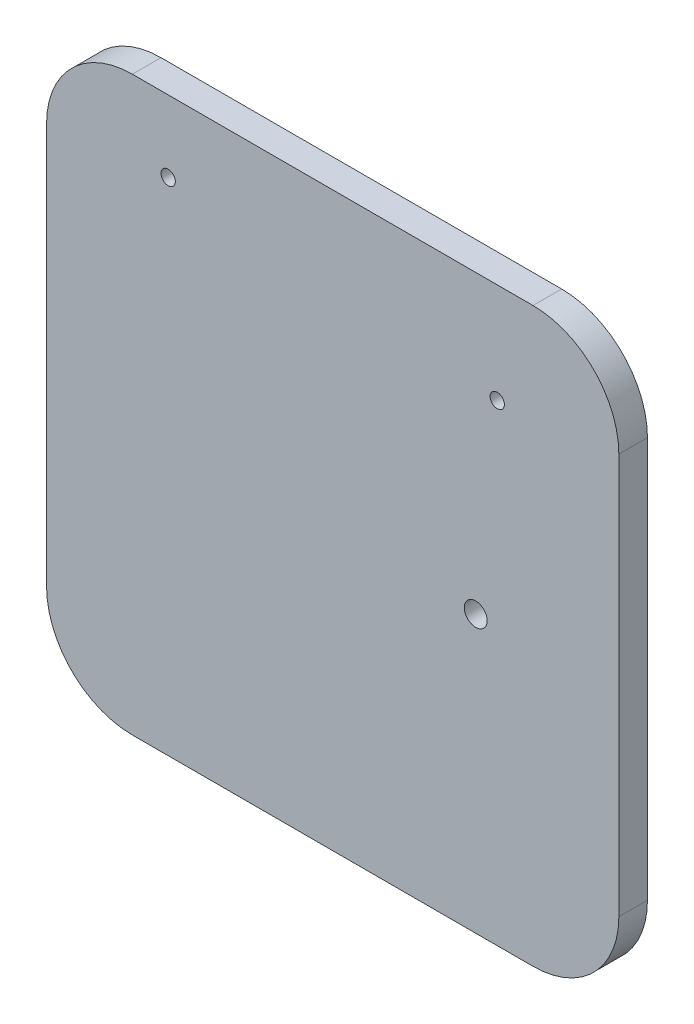
ISO-10303-21;
HEADER;
FILE_DESCRIPTION(('STEP AP214'),'2;1');
FILE_NAME('part.step','',(''),(''),'','','');
FILE_SCHEMA(('AUTOMOTIVE_DESIGN { 1 0 10303 214 1 1 1 1 }'));
ENDSEC;
DATA;
#1=APPLICATION_CONTEXT('core data for automotive mechanical design processes');
#2=APPLICATION_PROTOCOL_DEFINITION('international standard','automotive_design',2000,#1);
#3=PRODUCT_CONTEXT('',#1,'mechanical');
#4=PRODUCT('Part','Part','',(#3));
#5=PRODUCT_RELATED_PRODUCT_CATEGORY('part','',(#4));
#6=PRODUCT_DEFINITION_FORMATION('','',#4);
#7=PRODUCT_DEFINITION_CONTEXT('part definition',#1,'design');
#8=PRODUCT_DEFINITION('design','',#6,#7);
#9=PRODUCT_DEFINITION_SHAPE('','',#8);
#10=(LENGTH_UNIT() NAMED_UNIT(*) SI_UNIT(.MILLI.,.METRE.));
#11=(NAMED_UNIT(*) PLANE_ANGLE_UNIT() SI_UNIT($,.RADIAN.));
#12=(NAMED_UNIT(*) SI_UNIT($,.STERADIAN.) SOLID_ANGLE_UNIT());
#13=UNCERTAINTY_MEASURE_WITH_UNIT(LENGTH_MEASURE(1.E-05),#10,'distance_accuracy_value','');
#14=(GEOMETRIC_REPRESENTATION_CONTEXT(3) GLOBAL_UNCERTAINTY_ASSIGNED_CONTEXT((#13)) GLOBAL_UNIT_ASSIGNED_CONTEXT((#10,
#11,#12)) REPRESENTATION_CONTEXT('',''));
#15=CARTESIAN_POINT('',(0.,0.,0.));
#16=DIRECTION('',(0.,0.,1.));
#17=DIRECTION('',(1.,0.,0.));
#18=AXIS2_PLACEMENT_3D('',#15,#16,#17);
#19=CARTESIAN_POINT('',(-70.,-70.,10.));
#20=DIRECTION('',(0.,0.,-1.));
#21=DIRECTION('',(-1.,0.,0.));
#22=AXIS2_PLACEMENT_3D('',#19,#20,#21);
#23=PLANE('',#22);
#24=CARTESIAN_POINT('',(-57.5,75.,10.));
#25=DIRECTION('',(0.,0.,-1.));
#26=DIRECTION('',(-1.,0.,0.));
#27=AXIS2_PLACEMENT_3D('',#24,#25,#26);
#28=CIRCLE('',#27,2.5);
#29=CARTESIAN_POINT('',(-60.,75.,10.));
#30=VERTEX_POINT('',#29);
#31=EDGE_CURVE('E182',#30,#30,#28,.F.);
#32=ORIENTED_EDGE('',*,*,#31,.F.);
#33=EDGE_LOOP('',(#32));
#34=FACE_BOUND('',#33,.T.);
#35=CARTESIAN_POINT('',(57.5,65.,10.));
#36=DIRECTION('',(0.,0.,-1.));
#37=DIRECTION('',(-1.,0.,0.));
#38=AXIS2_PLACEMENT_3D('',#35,#36,#37);
#39=CIRCLE('',#38,2.5);
#40=CARTESIAN_POINT('',(55.,65.,10.));
#41=VERTEX_POINT('',#40);
#42=EDGE_CURVE('E187',#41,#41,#39,.F.);
#43=ORIENTED_EDGE('',*,*,#42,.F.);
#44=EDGE_LOOP('',(#43));
#45=FACE_BOUND('',#44,.T.);
#46=CARTESIAN_POINT('',(-70.,-70.,10.));
#47=DIRECTION('',(0.,0.,1.));
#48=DIRECTION('',(-1.,0.,0.));
#49=AXIS2_PLACEMENT_3D('',#46,#47,#48);
#50=CIRCLE('',#49,30.);
#51=CARTESIAN_POINT('',(-100.,-69.9999999999998,10.));
#52=VERTEX_POINT('',#51);
#53=CARTESIAN_POINT('',(-69.9999999999998,-100.,10.));
#54=VERTEX_POINT('',#53);
#55=EDGE_CURVE('E145',#52,#54,#50,.T.);
#56=ORIENTED_EDGE('',*,*,#55,.T.);
#57=DIRECTION('',(1.,0.,0.));
#58=VECTOR('',#57,1.);
#59=CARTESIAN_POINT('',(-69.9999999999998,-100.,10.));
#60=LINE('',#59,#58);
#61=CARTESIAN_POINT('',(69.9999999999998,-100.,10.));
#62=VERTEX_POINT('',#61);
#63=EDGE_CURVE('E93',#54,#62,#60,.T.);
#64=ORIENTED_EDGE('',*,*,#63,.T.);
#65=CARTESIAN_POINT('',(70.,-70.,10.));
#66=DIRECTION('',(0.,0.,1.));
#67=DIRECTION('',(1.,0.,0.));
#68=AXIS2_PLACEMENT_3D('',#65,#66,#67);
#69=CIRCLE('',#68,30.);
#70=CARTESIAN_POINT('',(100.,-70.,10.));
#71=VERTEX_POINT('',#70);
#72=EDGE_CURVE('E160',#62,#71,#69,.T.);
#73=ORIENTED_EDGE('',*,*,#72,.T.);
#74=DIRECTION('',(0.,1.,0.));
#75=VECTOR('',#74,1.);
#76=CARTESIAN_POINT('',(100.,-69.9999999999998,10.));
#77=LINE('',#76,#75);
#78=CARTESIAN_POINT('',(100.,69.9999999999998,10.));
#79=VERTEX_POINT('',#78);
#80=EDGE_CURVE('E173',#71,#79,#77,.T.);
#81=ORIENTED_EDGE('',*,*,#80,.T.);
#82=CARTESIAN_POINT('',(70.,70.,10.));
#83=DIRECTION('',(0.,0.,1.));
#84=DIRECTION('',(-1.,0.,0.));
#85=AXIS2_PLACEMENT_3D('',#82,#83,#84);
#86=CIRCLE('',#85,30.);
#87=CARTESIAN_POINT('',(69.9999999999998,100.,10.));
#88=VERTEX_POINT('',#87);
#89=EDGE_CURVE('E112',#79,#88,#86,.T.);
#90=ORIENTED_EDGE('',*,*,#89,.T.);
#91=DIRECTION('',(-1.,0.,0.));
#92=VECTOR('',#91,1.);
#93=CARTESIAN_POINT('',(-69.9999999999998,100.,10.));
#94=LINE('',#93,#92);
#95=CARTESIAN_POINT('',(-69.9999999999998,100.,10.));
#96=VERTEX_POINT('',#95);
#97=EDGE_CURVE('E106',#88,#96,#94,.T.);
#98=ORIENTED_EDGE('',*,*,#97,.T.);
#99=CARTESIAN_POINT('',(-70.,70.,10.));
#100=DIRECTION('',(0.,0.,1.));
#101=DIRECTION('',(-1.,0.,0.));
#102=AXIS2_PLACEMENT_3D('',#99,#100,#101);
#103=CIRCLE('',#102,30.);
#104=CARTESIAN_POINT('',(-100.,69.9999999999998,10.));
#105=VERTEX_POINT('',#104);
#106=EDGE_CURVE('E110',#96,#105,#103,.T.);
#107=ORIENTED_EDGE('',*,*,#106,.T.);
#108=DIRECTION('',(0.,-1.,0.));
#109=VECTOR('',#108,1.);
#110=CARTESIAN_POINT('',(-100.,-69.9999999999998,10.));
#111=LINE('',#110,#109);
#112=EDGE_CURVE('E50',#105,#52,#111,.T.);
#113=ORIENTED_EDGE('',*,*,#112,.T.);
#114=EDGE_LOOP('',(#56,#64,#73,#81,#90,#98,#107,#113));
#115=FACE_BOUND('',#114,.T.);
#116=CARTESIAN_POINT('',(49.9830026123236,-3.42941593248375,10.));
#117=DIRECTION('',(0.,0.,1.));
#118=DIRECTION('',(1.,0.,0.));
#119=AXIS2_PLACEMENT_3D('',#116,#117,#118);
#120=CIRCLE('',#119,4.00000000000001);
#121=CARTESIAN_POINT('',(53.9830026123236,-3.42941593248375,10.));
#122=VERTEX_POINT('',#121);
#123=EDGE_CURVE('E134',#122,#122,#120,.T.);
#124=ORIENTED_EDGE('',*,*,#123,.F.);
#125=EDGE_LOOP('',(#124));
#126=FACE_BOUND('',#125,.T.);
#127=ADVANCED_FACE('F33',(#34,#45,#115,#126),#23,.F.);
#128=CARTESIAN_POINT('',(-70.,-70.,0.));
#129=DIRECTION('',(0.,0.,-1.));
#130=DIRECTION('',(-1.,0.,0.));
#131=AXIS2_PLACEMENT_3D('',#128,#129,#130);
#132=PLANE('',#131);
#133=CARTESIAN_POINT('',(-57.5,75.,0.));
#134=DIRECTION('',(0.,0.,1.));
#135=DIRECTION('',(1.,0.,0.));
#136=AXIS2_PLACEMENT_3D('',#133,#134,#135);
#137=CIRCLE('',#136,2.5);
#138=CARTESIAN_POINT('',(-55.,75.,0.));
#139=VERTEX_POINT('',#138);
#140=EDGE_CURVE('E190',#139,#139,#137,.T.);
#141=ORIENTED_EDGE('',*,*,#140,.T.);
#142=EDGE_LOOP('',(#141));
#143=FACE_BOUND('',#142,.T.);
#144=CARTESIAN_POINT('',(57.5,65.,0.));
#145=DIRECTION('',(0.,0.,1.));
#146=DIRECTION('',(1.,0.,0.));
#147=AXIS2_PLACEMENT_3D('',#144,#145,#146);
#148=CIRCLE('',#147,2.5);
#149=CARTESIAN_POINT('',(60.,65.,0.));
#150=VERTEX_POINT('',#149);
#151=EDGE_CURVE('E191',#150,#150,#148,.T.);
#152=ORIENTED_EDGE('',*,*,#151,.T.);
#153=EDGE_LOOP('',(#152));
#154=FACE_BOUND('',#153,.T.);
#155=CARTESIAN_POINT('',(-70.,-70.,0.));
#156=DIRECTION('',(0.,0.,1.));
#157=DIRECTION('',(-1.,0.,0.));
#158=AXIS2_PLACEMENT_3D('',#155,#156,#157);
#159=CIRCLE('',#158,30.);
#160=CARTESIAN_POINT('',(-100.,-69.9999999999998,0.));
#161=VERTEX_POINT('',#160);
#162=CARTESIAN_POINT('',(-69.9999999999998,-100.,0.));
#163=VERTEX_POINT('',#162);
#164=EDGE_CURVE('E130',#161,#163,#159,.T.);
#165=ORIENTED_EDGE('',*,*,#164,.F.);
#166=DIRECTION('',(0.,-1.,0.));
#167=VECTOR('',#166,1.);
#168=CARTESIAN_POINT('',(-100.,-69.9999999999998,0.));
#169=LINE('',#168,#167);
#170=CARTESIAN_POINT('',(-100.,69.9999999999998,0.));
#171=VERTEX_POINT('',#170);
#172=EDGE_CURVE('E85',#171,#161,#169,.T.);
#173=ORIENTED_EDGE('',*,*,#172,.F.);
#174=CARTESIAN_POINT('',(-70.,70.,0.));
#175=DIRECTION('',(0.,0.,1.));
#176=DIRECTION('',(-1.,0.,0.));
#177=AXIS2_PLACEMENT_3D('',#174,#175,#176);
#178=CIRCLE('',#177,30.);
#179=CARTESIAN_POINT('',(-69.9999999999998,100.,0.));
#180=VERTEX_POINT('',#179);
#181=EDGE_CURVE('E79',#180,#171,#178,.T.);
#182=ORIENTED_EDGE('',*,*,#181,.F.);
#183=DIRECTION('',(-1.,0.,0.));
#184=VECTOR('',#183,1.);
#185=CARTESIAN_POINT('',(-69.9999999999998,100.,0.));
#186=LINE('',#185,#184);
#187=CARTESIAN_POINT('',(69.9999999999998,100.,0.));
#188=VERTEX_POINT('',#187);
#189=EDGE_CURVE('E120',#188,#180,#186,.T.);
#190=ORIENTED_EDGE('',*,*,#189,.F.);
#191=CARTESIAN_POINT('',(70.,70.,0.));
#192=DIRECTION('',(0.,0.,1.));
#193=DIRECTION('',(-1.,0.,0.));
#194=AXIS2_PLACEMENT_3D('',#191,#192,#193);
#195=CIRCLE('',#194,30.);
#196=CARTESIAN_POINT('',(100.,69.9999999999998,0.));
#197=VERTEX_POINT('',#196);
#198=EDGE_CURVE('E140',#197,#188,#195,.T.);
#199=ORIENTED_EDGE('',*,*,#198,.F.);
#200=DIRECTION('',(0.,1.,0.));
#201=VECTOR('',#200,1.);
#202=CARTESIAN_POINT('',(100.,-69.9999999999998,0.));
#203=LINE('',#202,#201);
#204=CARTESIAN_POINT('',(100.,-70.,0.));
#205=VERTEX_POINT('',#204);
#206=EDGE_CURVE('E138',#205,#197,#203,.T.);
#207=ORIENTED_EDGE('',*,*,#206,.F.);
#208=CARTESIAN_POINT('',(70.,-70.,0.));
#209=DIRECTION('',(0.,0.,1.));
#210=DIRECTION('',(1.,0.,0.));
#211=AXIS2_PLACEMENT_3D('',#208,#209,#210);
#212=CIRCLE('',#211,30.);
#213=CARTESIAN_POINT('',(69.9999999999998,-100.,0.));
#214=VERTEX_POINT('',#213);
#215=EDGE_CURVE('E136',#214,#205,#212,.T.);
#216=ORIENTED_EDGE('',*,*,#215,.F.);
#217=DIRECTION('',(1.,0.,0.));
#218=VECTOR('',#217,1.);
#219=CARTESIAN_POINT('',(-69.9999999999998,-100.,0.));
#220=LINE('',#219,#218);
#221=EDGE_CURVE('E133',#163,#214,#220,.T.);
#222=ORIENTED_EDGE('',*,*,#221,.F.);
#223=EDGE_LOOP('',(#165,#173,#182,#190,#199,#207,#216,#222));
#224=FACE_BOUND('',#223,.T.);
#225=CARTESIAN_POINT('',(49.9830026123236,-3.42941593248375,0.));
#226=DIRECTION('',(0.,0.,1.));
#227=DIRECTION('',(1.,0.,0.));
#228=AXIS2_PLACEMENT_3D('',#225,#226,#227);
#229=CIRCLE('',#228,4.00000000000001);
#230=CARTESIAN_POINT('',(53.9830026123236,-3.42941593248375,0.));
#231=VERTEX_POINT('',#230);
#232=EDGE_CURVE('E179',#231,#231,#229,.T.);
#233=ORIENTED_EDGE('',*,*,#232,.T.);
#234=EDGE_LOOP('',(#233));
#235=FACE_BOUND('',#234,.T.);
#236=ADVANCED_FACE('F164',(#143,#154,#224,#235),#132,.T.);
#237=CARTESIAN_POINT('',(-70.,-70.,10.));
#238=DIRECTION('',(0.,0.,-1.));
#239=DIRECTION('',(-1.,0.,0.));
#240=AXIS2_PLACEMENT_3D('',#237,#238,#239);
#241=CYLINDRICAL_SURFACE('',#240,30.);
#242=ORIENTED_EDGE('',*,*,#164,.T.);
#243=DIRECTION('',(0.,0.,-1.));
#244=VECTOR('',#243,1.);
#245=CARTESIAN_POINT('',(-69.9999999999998,-100.,10.));
#246=LINE('',#245,#244);
#247=EDGE_CURVE('E11',#54,#163,#246,.T.);
#248=ORIENTED_EDGE('',*,*,#247,.F.);
#249=ORIENTED_EDGE('',*,*,#55,.F.);
#250=DIRECTION('',(0.,0.,-1.));
#251=VECTOR('',#250,1.);
#252=CARTESIAN_POINT('',(-100.,-69.9999999999998,10.));
#253=LINE('',#252,#251);
#254=EDGE_CURVE('E126',#52,#161,#253,.T.);
#255=ORIENTED_EDGE('',*,*,#254,.T.);
#256=EDGE_LOOP('',(#242,#248,#249,#255));
#257=FACE_BOUND('',#256,.T.);
#258=ADVANCED_FACE('F35',(#257),#241,.T.);
#259=CARTESIAN_POINT('',(-69.9999999999998,-100.,10.));
#260=DIRECTION('',(0.,1.,0.));
#261=DIRECTION('',(0.,0.,1.));
#262=AXIS2_PLACEMENT_3D('',#259,#260,#261);
#263=PLANE('',#262);
#264=ORIENTED_EDGE('',*,*,#221,.T.);
#265=DIRECTION('',(0.,0.,-1.));
#266=VECTOR('',#265,1.);
#267=CARTESIAN_POINT('',(69.9999999999998,-100.,10.));
#268=LINE('',#267,#266);
#269=EDGE_CURVE('E42',#62,#214,#268,.T.);
#270=ORIENTED_EDGE('',*,*,#269,.F.);
#271=ORIENTED_EDGE('',*,*,#63,.F.);
#272=ORIENTED_EDGE('',*,*,#247,.T.);
#273=EDGE_LOOP('',(#264,#270,#271,#272));
#274=FACE_BOUND('',#273,.T.);
#275=ADVANCED_FACE('F236',(#274),#263,.F.);
#276=CARTESIAN_POINT('',(70.,-70.,10.));
#277=DIRECTION('',(0.,0.,-1.));
#278=DIRECTION('',(-1.,0.,0.));
#279=AXIS2_PLACEMENT_3D('',#276,#277,#278);
#280=CYLINDRICAL_SURFACE('',#279,30.);
#281=ORIENTED_EDGE('',*,*,#215,.T.);
#282=DIRECTION('',(0.,0.,-1.));
#283=VECTOR('',#282,1.);
#284=CARTESIAN_POINT('',(100.,-70.,10.));
#285=LINE('',#284,#283);
#286=EDGE_CURVE('E152',#71,#205,#285,.T.);
#287=ORIENTED_EDGE('',*,*,#286,.F.);
#288=ORIENTED_EDGE('',*,*,#72,.F.);
#289=ORIENTED_EDGE('',*,*,#269,.T.);
#290=EDGE_LOOP('',(#281,#287,#288,#289));
#291=FACE_BOUND('',#290,.T.);
#292=ADVANCED_FACE('F158',(#291),#280,.T.);
#293=CARTESIAN_POINT('',(100.,-69.9999999999998,10.));
#294=DIRECTION('',(-1.,0.,0.));
#295=DIRECTION('',(0.,0.,1.));
#296=AXIS2_PLACEMENT_3D('',#293,#294,#295);
#297=PLANE('',#296);
#298=ORIENTED_EDGE('',*,*,#206,.T.);
#299=DIRECTION('',(0.,0.,-1.));
#300=VECTOR('',#299,1.);
#301=CARTESIAN_POINT('',(100.,69.9999999999998,10.));
#302=LINE('',#301,#300);
#303=EDGE_CURVE('E149',#79,#197,#302,.T.);
#304=ORIENTED_EDGE('',*,*,#303,.F.);
#305=ORIENTED_EDGE('',*,*,#80,.F.);
#306=ORIENTED_EDGE('',*,*,#286,.T.);
#307=EDGE_LOOP('',(#298,#304,#305,#306));
#308=FACE_BOUND('',#307,.T.);
#309=ADVANCED_FACE('F169',(#308),#297,.F.);
#310=CARTESIAN_POINT('',(70.,70.,10.));
#311=DIRECTION('',(0.,0.,-1.));
#312=DIRECTION('',(-1.,0.,0.));
#313=AXIS2_PLACEMENT_3D('',#310,#311,#312);
#314=CYLINDRICAL_SURFACE('',#313,30.);
#315=ORIENTED_EDGE('',*,*,#198,.T.);
#316=DIRECTION('',(0.,0.,-1.));
#317=VECTOR('',#316,1.);
#318=CARTESIAN_POINT('',(69.9999999999998,100.,10.));
#319=LINE('',#318,#317);
#320=EDGE_CURVE('E121',#88,#188,#319,.T.);
#321=ORIENTED_EDGE('',*,*,#320,.F.);
#322=ORIENTED_EDGE('',*,*,#89,.F.);
#323=ORIENTED_EDGE('',*,*,#303,.T.);
#324=EDGE_LOOP('',(#315,#321,#322,#323));
#325=FACE_BOUND('',#324,.T.);
#326=ADVANCED_FACE('F172',(#325),#314,.T.);
#327=CARTESIAN_POINT('',(-69.9999999999998,100.,10.));
#328=DIRECTION('',(0.,-1.,0.));
#329=DIRECTION('',(0.,0.,-1.));
#330=AXIS2_PLACEMENT_3D('',#327,#328,#329);
#331=PLANE('',#330);
#332=ORIENTED_EDGE('',*,*,#189,.T.);
#333=DIRECTION('',(0.,0.,-1.));
#334=VECTOR('',#333,1.);
#335=CARTESIAN_POINT('',(-69.9999999999998,100.,10.));
#336=LINE('',#335,#334);
#337=EDGE_CURVE('E117',#96,#180,#336,.T.);
#338=ORIENTED_EDGE('',*,*,#337,.F.);
#339=ORIENTED_EDGE('',*,*,#97,.F.);
#340=ORIENTED_EDGE('',*,*,#320,.T.);
#341=EDGE_LOOP('',(#332,#338,#339,#340));
#342=FACE_BOUND('',#341,.T.);
#343=ADVANCED_FACE('F118',(#342),#331,.F.);
#344=CARTESIAN_POINT('',(-70.,70.,10.));
#345=DIRECTION('',(0.,0.,-1.));
#346=DIRECTION('',(-1.,0.,0.));
#347=AXIS2_PLACEMENT_3D('',#344,#345,#346);
#348=CYLINDRICAL_SURFACE('',#347,30.);
#349=ORIENTED_EDGE('',*,*,#181,.T.);
#350=DIRECTION('',(0.,0.,-1.));
#351=VECTOR('',#350,1.);
#352=CARTESIAN_POINT('',(-100.,69.9999999999998,10.));
#353=LINE('',#352,#351);
#354=EDGE_CURVE('E122',#105,#171,#353,.T.);
#355=ORIENTED_EDGE('',*,*,#354,.F.);
#356=ORIENTED_EDGE('',*,*,#106,.F.);
#357=ORIENTED_EDGE('',*,*,#337,.T.);
#358=EDGE_LOOP('',(#349,#355,#356,#357));
#359=FACE_BOUND('',#358,.T.);
#360=ADVANCED_FACE('F124',(#359),#348,.T.);
#361=CARTESIAN_POINT('',(-100.,-69.9999999999998,10.));
#362=DIRECTION('',(1.,0.,0.));
#363=DIRECTION('',(0.,0.,-1.));
#364=AXIS2_PLACEMENT_3D('',#361,#362,#363);
#365=PLANE('',#364);
#366=ORIENTED_EDGE('',*,*,#172,.T.);
#367=ORIENTED_EDGE('',*,*,#254,.F.);
#368=ORIENTED_EDGE('',*,*,#112,.F.);
#369=ORIENTED_EDGE('',*,*,#354,.T.);
#370=EDGE_LOOP('',(#366,#367,#368,#369));
#371=FACE_BOUND('',#370,.T.);
#372=ADVANCED_FACE('F218',(#371),#365,.F.);
#373=CARTESIAN_POINT('',(49.9830026123236,-3.42941593248375,10.));
#374=DIRECTION('',(0.,0.,-1.));
#375=DIRECTION('',(-1.,0.,0.));
#376=AXIS2_PLACEMENT_3D('',#373,#374,#375);
#377=CYLINDRICAL_SURFACE('',#376,4.00000000000001);
#378=ORIENTED_EDGE('',*,*,#123,.T.);
#379=EDGE_LOOP('',(#378));
#380=FACE_BOUND('',#379,.T.);
#381=ORIENTED_EDGE('',*,*,#232,.F.);
#382=EDGE_LOOP('',(#381));
#383=FACE_BOUND('',#382,.T.);
#384=ADVANCED_FACE('F212',(#380,#383),#377,.F.);
#385=CARTESIAN_POINT('',(57.5,65.,10.000012));
#386=DIRECTION('',(0.,0.,-1.));
#387=DIRECTION('',(-1.,0.,0.));
#388=AXIS2_PLACEMENT_3D('',#385,#386,#387);
#389=CYLINDRICAL_SURFACE('',#388,2.5);
#390=ORIENTED_EDGE('',*,*,#151,.F.);
#391=EDGE_LOOP('',(#390));
#392=FACE_BOUND('',#391,.T.);
#393=ORIENTED_EDGE('',*,*,#42,.T.);
#394=EDGE_LOOP('',(#393));
#395=FACE_BOUND('',#394,.T.);
#396=ADVANCED_FACE('F202',(#392,#395),#389,.F.);
#397=CARTESIAN_POINT('',(-57.5,75.,10.000012));
#398=DIRECTION('',(0.,0.,-1.));
#399=DIRECTION('',(-1.,0.,0.));
#400=AXIS2_PLACEMENT_3D('',#397,#398,#399);
#401=CYLINDRICAL_SURFACE('',#400,2.5);
#402=ORIENTED_EDGE('',*,*,#140,.F.);
#403=EDGE_LOOP('',(#402));
#404=FACE_BOUND('',#403,.T.);
#405=ORIENTED_EDGE('',*,*,#31,.T.);
#406=EDGE_LOOP('',(#405));
#407=FACE_BOUND('',#406,.T.);
#408=ADVANCED_FACE('F199',(#404,#407),#401,.F.);
#409=CLOSED_SHELL('',(#127,#236,#258,#275,#292,#309,#326,#343,#360,#372,#384,#396,#408));
#410=MANIFOLD_SOLID_BREP('B2',#409);
#411=ADVANCED_BREP_SHAPE_REPRESENTATION('',(#18,#410),#14);
#412=SHAPE_DEFINITION_REPRESENTATION(#9,#411);
ENDSEC;
END-ISO-10303-21;
